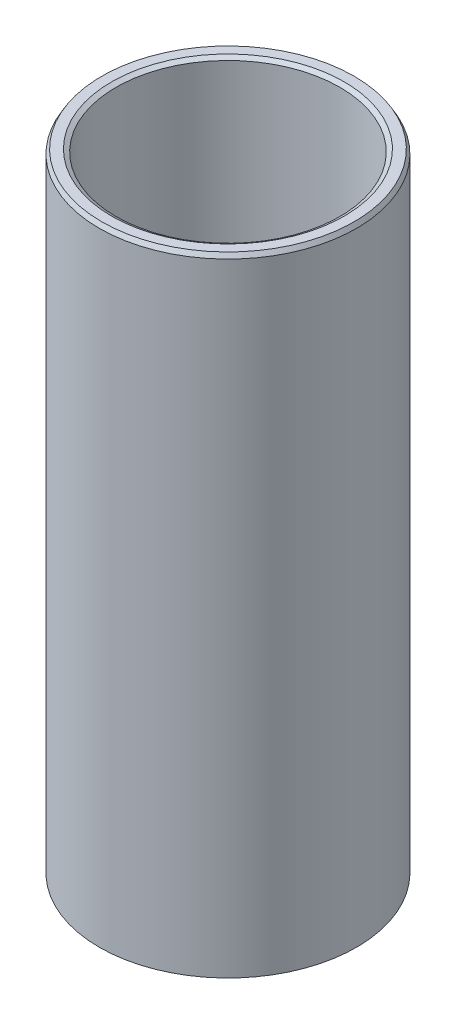
ISO-10303-21;
HEADER;
FILE_DESCRIPTION(('STEP AP214'),'2;1');
FILE_NAME('part.step','',(''),(''),'','','');
FILE_SCHEMA(('AUTOMOTIVE_DESIGN { 1 0 10303 214 1 1 1 1 }'));
ENDSEC;
DATA;
#1=APPLICATION_CONTEXT('core data for automotive mechanical design processes');
#2=APPLICATION_PROTOCOL_DEFINITION('international standard','automotive_design',2000,#1);
#3=PRODUCT_CONTEXT('',#1,'mechanical');
#4=PRODUCT('Part','Part','',(#3));
#5=PRODUCT_RELATED_PRODUCT_CATEGORY('part','',(#4));
#6=PRODUCT_DEFINITION_FORMATION('','',#4);
#7=PRODUCT_DEFINITION_CONTEXT('part definition',#1,'design');
#8=PRODUCT_DEFINITION('design','',#6,#7);
#9=PRODUCT_DEFINITION_SHAPE('','',#8);
#10=(LENGTH_UNIT() NAMED_UNIT(*) SI_UNIT(.MILLI.,.METRE.));
#11=(NAMED_UNIT(*) PLANE_ANGLE_UNIT() SI_UNIT($,.RADIAN.));
#12=(NAMED_UNIT(*) SI_UNIT($,.STERADIAN.) SOLID_ANGLE_UNIT());
#13=UNCERTAINTY_MEASURE_WITH_UNIT(LENGTH_MEASURE(1.E-05),#10,'distance_accuracy_value','');
#14=(GEOMETRIC_REPRESENTATION_CONTEXT(3) GLOBAL_UNCERTAINTY_ASSIGNED_CONTEXT((#13)) GLOBAL_UNIT_ASSIGNED_CONTEXT((#10,
#11,#12)) REPRESENTATION_CONTEXT('',''));
#15=CARTESIAN_POINT('',(0.,0.,0.));
#16=DIRECTION('',(0.,0.,1.));
#17=DIRECTION('',(1.,0.,0.));
#18=AXIS2_PLACEMENT_3D('',#15,#16,#17);
#19=CARTESIAN_POINT('',(0.,232.37679414919,0.));
#20=DIRECTION('',(0.,-1.,0.));
#21=DIRECTION('',(0.,0.,-1.));
#22=AXIS2_PLACEMENT_3D('',#19,#20,#21);
#23=CYLINDRICAL_SURFACE('',#22,47.5);
#24=CARTESIAN_POINT('',(0.,0.934117038850019,0.));
#25=DIRECTION('',(0.,1.,0.));
#26=DIRECTION('',(0.,0.,1.));
#27=AXIS2_PLACEMENT_3D('',#24,#25,#26);
#28=CIRCLE('',#27,47.5);
#29=CARTESIAN_POINT('',(0.,0.934117038850019,47.5));
#30=VERTEX_POINT('',#29);
#31=EDGE_CURVE('E10',#30,#30,#28,.T.);
#32=ORIENTED_EDGE('',*,*,#31,.T.);
#33=EDGE_LOOP('',(#32));
#34=FACE_BOUND('',#33,.T.);
#35=CARTESIAN_POINT('',(0.,230.758855977686,0.));
#36=DIRECTION('',(0.,1.,0.));
#37=DIRECTION('',(0.,0.,1.));
#38=AXIS2_PLACEMENT_3D('',#35,#36,#37);
#39=CIRCLE('',#38,47.5);
#40=CARTESIAN_POINT('',(0.,230.758855977686,47.5));
#41=VERTEX_POINT('',#40);
#42=EDGE_CURVE('E50',#41,#41,#39,.F.);
#43=ORIENTED_EDGE('',*,*,#42,.T.);
#44=EDGE_LOOP('',(#43));
#45=FACE_BOUND('',#44,.T.);
#46=ADVANCED_FACE('F39',(#34,#45),#23,.T.);
#47=CARTESIAN_POINT('',(0.,232.37679414919,0.));
#48=DIRECTION('',(0.,1.,0.));
#49=DIRECTION('',(0.,0.,1.));
#50=AXIS2_PLACEMENT_3D('',#47,#48,#49);
#51=PLANE('',#50);
#52=CARTESIAN_POINT('',(0.,232.37679414919,0.));
#53=DIRECTION('',(0.,1.,0.));
#54=DIRECTION('',(0.,0.,1.));
#55=AXIS2_PLACEMENT_3D('',#52,#53,#54);
#56=CIRCLE('',#55,42.9459426211404);
#57=CARTESIAN_POINT('',(0.,232.37679414919,42.9459426211404));
#58=VERTEX_POINT('',#57);
#59=EDGE_CURVE('E58',#58,#58,#56,.F.);
#60=ORIENTED_EDGE('',*,*,#59,.T.);
#61=EDGE_LOOP('',(#60));
#62=FACE_BOUND('',#61,.T.);
#63=CARTESIAN_POINT('',(0.,232.37679414919,0.));
#64=DIRECTION('',(0.,1.,0.));
#65=DIRECTION('',(0.,0.,1.));
#66=AXIS2_PLACEMENT_3D('',#63,#64,#65);
#67=CIRCLE('',#66,46.56588296115);
#68=CARTESIAN_POINT('',(0.,232.37679414919,46.56588296115));
#69=VERTEX_POINT('',#68);
#70=EDGE_CURVE('E61',#69,#69,#67,.T.);
#71=ORIENTED_EDGE('',*,*,#70,.T.);
#72=EDGE_LOOP('',(#71));
#73=FACE_BOUND('',#72,.T.);
#74=ADVANCED_FACE('F88',(#62,#73),#51,.T.);
#75=CARTESIAN_POINT('',(0.,0.,0.));
#76=DIRECTION('',(0.,1.,0.));
#77=DIRECTION('',(0.,0.,1.));
#78=AXIS2_PLACEMENT_3D('',#75,#76,#77);
#79=PLANE('',#78);
#80=CARTESIAN_POINT('',(0.,0.,0.));
#81=DIRECTION('',(0.,1.,0.));
#82=DIRECTION('',(0.,0.,1.));
#83=AXIS2_PLACEMENT_3D('',#80,#81,#82);
#84=CIRCLE('',#83,42.2621214884864);
#85=CARTESIAN_POINT('',(0.,0.,42.2621214884864));
#86=VERTEX_POINT('',#85);
#87=EDGE_CURVE('E51',#86,#86,#84,.T.);
#88=ORIENTED_EDGE('',*,*,#87,.T.);
#89=EDGE_LOOP('',(#88));
#90=FACE_BOUND('',#89,.T.);
#91=CARTESIAN_POINT('',(0.,0.,0.));
#92=DIRECTION('',(0.,1.,0.));
#93=DIRECTION('',(0.,0.,1.));
#94=AXIS2_PLACEMENT_3D('',#91,#92,#93);
#95=CIRCLE('',#94,45.882061828496);
#96=CARTESIAN_POINT('',(0.,0.,45.882061828496));
#97=VERTEX_POINT('',#96);
#98=EDGE_CURVE('E54',#97,#97,#95,.F.);
#99=ORIENTED_EDGE('',*,*,#98,.T.);
#100=EDGE_LOOP('',(#99));
#101=FACE_BOUND('',#100,.T.);
#102=ADVANCED_FACE('F83',(#90,#101),#79,.F.);
#103=CARTESIAN_POINT('',(0.,232.37679414919,0.));
#104=DIRECTION('',(0.,-1.,0.));
#105=DIRECTION('',(0.,0.,-1.));
#106=AXIS2_PLACEMENT_3D('',#103,#104,#105);
#107=CYLINDRICAL_SURFACE('',#106,41.3280044496364);
#108=CARTESIAN_POINT('',(0.,231.44267711034,0.));
#109=DIRECTION('',(0.,1.,0.));
#110=DIRECTION('',(0.,0.,1.));
#111=AXIS2_PLACEMENT_3D('',#108,#109,#110);
#112=CIRCLE('',#111,41.3280044496364);
#113=CARTESIAN_POINT('',(0.,231.44267711034,41.3280044496364));
#114=VERTEX_POINT('',#113);
#115=EDGE_CURVE('E67',#114,#114,#112,.T.);
#116=ORIENTED_EDGE('',*,*,#115,.T.);
#117=EDGE_LOOP('',(#116));
#118=FACE_BOUND('',#117,.T.);
#119=CARTESIAN_POINT('',(0.,1.61793817150399,0.));
#120=DIRECTION('',(0.,1.,0.));
#121=DIRECTION('',(0.,0.,1.));
#122=AXIS2_PLACEMENT_3D('',#119,#120,#121);
#123=CIRCLE('',#122,41.3280044496364);
#124=CARTESIAN_POINT('',(0.,1.61793817150399,41.3280044496364));
#125=VERTEX_POINT('',#124);
#126=EDGE_CURVE('E69',#125,#125,#123,.F.);
#127=ORIENTED_EDGE('',*,*,#126,.T.);
#128=EDGE_LOOP('',(#127));
#129=FACE_BOUND('',#128,.T.);
#130=ADVANCED_FACE('F71',(#118,#129),#107,.F.);
#131=CARTESIAN_POINT('',(0.,231.44267711034,0.));
#132=DIRECTION('',(0.,1.,0.));
#133=DIRECTION('',(0.,0.,1.));
#134=AXIS2_PLACEMENT_3D('',#131,#132,#133);
#135=CONICAL_SURFACE('',#134,41.3280044496364,1.0471975511966);
#136=ORIENTED_EDGE('',*,*,#59,.F.);
#137=EDGE_LOOP('',(#136));
#138=FACE_BOUND('',#137,.T.);
#139=ORIENTED_EDGE('',*,*,#115,.F.);
#140=EDGE_LOOP('',(#139));
#141=FACE_BOUND('',#140,.T.);
#142=ADVANCED_FACE('F77',(#138,#141),#135,.F.);
#143=CARTESIAN_POINT('',(0.,0.,0.));
#144=DIRECTION('',(0.,-1.,0.));
#145=DIRECTION('',(0.,0.,-1.));
#146=AXIS2_PLACEMENT_3D('',#143,#144,#145);
#147=CONICAL_SURFACE('',#146,42.2621214884864,0.523598775598298);
#148=ORIENTED_EDGE('',*,*,#126,.F.);
#149=EDGE_LOOP('',(#148));
#150=FACE_BOUND('',#149,.T.);
#151=ORIENTED_EDGE('',*,*,#87,.F.);
#152=EDGE_LOOP('',(#151));
#153=FACE_BOUND('',#152,.T.);
#154=ADVANCED_FACE('F73',(#150,#153),#147,.F.);
#155=CARTESIAN_POINT('',(0.,0.934117038850019,0.));
#156=DIRECTION('',(0.,1.,0.));
#157=DIRECTION('',(0.,0.,1.));
#158=AXIS2_PLACEMENT_3D('',#155,#156,#157);
#159=CONICAL_SURFACE('',#158,47.5,1.04719755119659);
#160=ORIENTED_EDGE('',*,*,#98,.F.);
#161=EDGE_LOOP('',(#160));
#162=FACE_BOUND('',#161,.T.);
#163=ORIENTED_EDGE('',*,*,#31,.F.);
#164=EDGE_LOOP('',(#163));
#165=FACE_BOUND('',#164,.T.);
#166=ADVANCED_FACE('F76',(#162,#165),#159,.T.);
#167=CARTESIAN_POINT('',(0.,232.37679414919,0.));
#168=DIRECTION('',(0.,-1.,0.));
#169=DIRECTION('',(0.,0.,-1.));
#170=AXIS2_PLACEMENT_3D('',#167,#168,#169);
#171=CONICAL_SURFACE('',#170,46.56588296115,0.523598775598289);
#172=ORIENTED_EDGE('',*,*,#42,.F.);
#173=EDGE_LOOP('',(#172));
#174=FACE_BOUND('',#173,.T.);
#175=ORIENTED_EDGE('',*,*,#70,.F.);
#176=EDGE_LOOP('',(#175));
#177=FACE_BOUND('',#176,.T.);
#178=ADVANCED_FACE('F45',(#174,#177),#171,.T.);
#179=CLOSED_SHELL('',(#46,#74,#102,#130,#142,#154,#166,#178));
#180=MANIFOLD_SOLID_BREP('B2',#179);
#181=ADVANCED_BREP_SHAPE_REPRESENTATION('',(#18,#180),#14);
#182=SHAPE_DEFINITION_REPRESENTATION(#9,#181);
ENDSEC;
END-ISO-10303-21;
